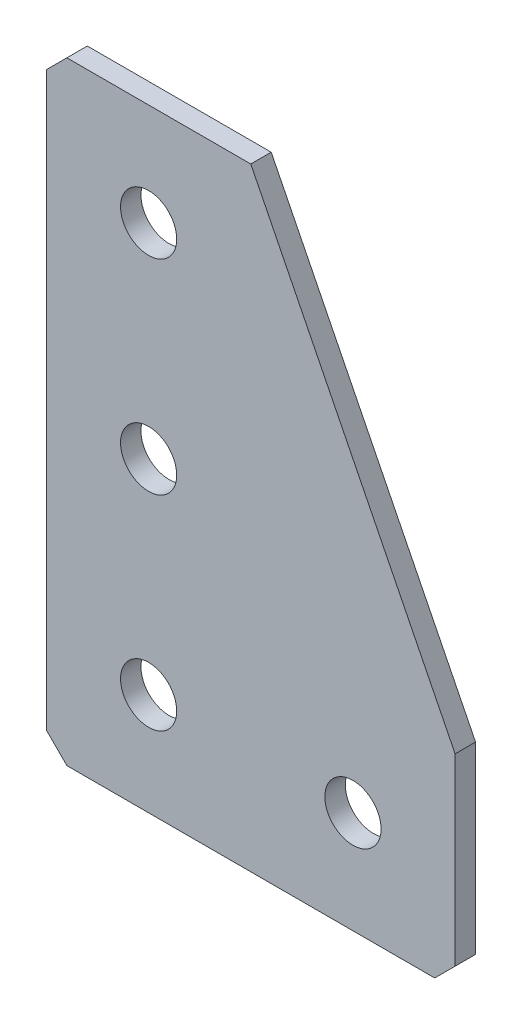
ISO-10303-21;
HEADER;
FILE_DESCRIPTION(('STEP AP214'),'2;1');
FILE_NAME('part.step','',(''),(''),'','','');
FILE_SCHEMA(('AUTOMOTIVE_DESIGN { 1 0 10303 214 1 1 1 1 }'));
ENDSEC;
DATA;
#1=APPLICATION_CONTEXT('core data for automotive mechanical design processes');
#2=APPLICATION_PROTOCOL_DEFINITION('international standard','automotive_design',2000,#1);
#3=PRODUCT_CONTEXT('',#1,'mechanical');
#4=PRODUCT('Part','Part','',(#3));
#5=PRODUCT_RELATED_PRODUCT_CATEGORY('part','',(#4));
#6=PRODUCT_DEFINITION_FORMATION('','',#4);
#7=PRODUCT_DEFINITION_CONTEXT('part definition',#1,'design');
#8=PRODUCT_DEFINITION('design','',#6,#7);
#9=PRODUCT_DEFINITION_SHAPE('','',#8);
#10=(LENGTH_UNIT() NAMED_UNIT(*) SI_UNIT(.MILLI.,.METRE.));
#11=(NAMED_UNIT(*) PLANE_ANGLE_UNIT() SI_UNIT($,.RADIAN.));
#12=(NAMED_UNIT(*) SI_UNIT($,.STERADIAN.) SOLID_ANGLE_UNIT());
#13=UNCERTAINTY_MEASURE_WITH_UNIT(LENGTH_MEASURE(1.E-05),#10,'distance_accuracy_value','');
#14=(GEOMETRIC_REPRESENTATION_CONTEXT(3) GLOBAL_UNCERTAINTY_ASSIGNED_CONTEXT((#13)) GLOBAL_UNIT_ASSIGNED_CONTEXT((#10,
#11,#12)) REPRESENTATION_CONTEXT('',''));
#15=CARTESIAN_POINT('',(0.,0.,0.));
#16=DIRECTION('',(0.,0.,1.));
#17=DIRECTION('',(1.,0.,0.));
#18=AXIS2_PLACEMENT_3D('',#15,#16,#17);
#19=CARTESIAN_POINT('',(20.,0.,-2.));
#20=DIRECTION('',(0.,-1.,0.));
#21=DIRECTION('',(1.,0.,0.));
#22=AXIS2_PLACEMENT_3D('',#19,#20,#21);
#23=PLANE('',#22);
#24=DIRECTION('',(1.,0.,0.));
#25=VECTOR('',#24,1.);
#26=CARTESIAN_POINT('',(20.,0.,-2.));
#27=LINE('',#26,#25);
#28=CARTESIAN_POINT('',(2.00000000000001,0.,-2.));
#29=VERTEX_POINT('',#28);
#30=CARTESIAN_POINT('',(20.,0.,-2.));
#31=VERTEX_POINT('',#30);
#32=EDGE_CURVE('E103',#29,#31,#27,.T.);
#33=ORIENTED_EDGE('',*,*,#32,.F.);
#34=DIRECTION('',(0.,0.,1.));
#35=VECTOR('',#34,1.);
#36=CARTESIAN_POINT('',(2.00000000000001,0.,-2.));
#37=LINE('',#36,#35);
#38=CARTESIAN_POINT('',(2.00000000000001,0.,0.));
#39=VERTEX_POINT('',#38);
#40=EDGE_CURVE('E132',#29,#39,#37,.T.);
#41=ORIENTED_EDGE('',*,*,#40,.T.);
#42=DIRECTION('',(1.,0.,0.));
#43=VECTOR('',#42,1.);
#44=CARTESIAN_POINT('',(20.,0.,0.));
#45=LINE('',#44,#43);
#46=CARTESIAN_POINT('',(20.,0.,0.));
#47=VERTEX_POINT('',#46);
#48=EDGE_CURVE('E129',#39,#47,#45,.T.);
#49=ORIENTED_EDGE('',*,*,#48,.T.);
#50=DIRECTION('',(0.,0.,1.));
#51=VECTOR('',#50,1.);
#52=CARTESIAN_POINT('',(20.,0.,-2.));
#53=LINE('',#52,#51);
#54=EDGE_CURVE('E121',#31,#47,#53,.T.);
#55=ORIENTED_EDGE('',*,*,#54,.F.);
#56=EDGE_LOOP('',(#33,#41,#49,#55));
#57=FACE_BOUND('',#56,.T.);
#58=ADVANCED_FACE('F38',(#57),#23,.F.);
#59=CARTESIAN_POINT('',(40.,-40.,-2.));
#60=DIRECTION('',(-0.894427190999916,-0.447213595499958,0.));
#61=DIRECTION('',(0.447213595499958,-0.894427190999916,0.));
#62=AXIS2_PLACEMENT_3D('',#59,#60,#61);
#63=PLANE('',#62);
#64=DIRECTION('',(0.447213595499958,-0.894427190999916,0.));
#65=VECTOR('',#64,1.);
#66=CARTESIAN_POINT('',(40.,-40.,0.));
#67=LINE('',#66,#65);
#68=CARTESIAN_POINT('',(40.,-40.,0.));
#69=VERTEX_POINT('',#68);
#70=EDGE_CURVE('E187',#47,#69,#67,.T.);
#71=ORIENTED_EDGE('',*,*,#70,.T.);
#72=DIRECTION('',(0.,0.,1.));
#73=VECTOR('',#72,1.);
#74=CARTESIAN_POINT('',(40.,-40.,-2.));
#75=LINE('',#74,#73);
#76=CARTESIAN_POINT('',(40.,-40.,-2.));
#77=VERTEX_POINT('',#76);
#78=EDGE_CURVE('E123',#77,#69,#75,.T.);
#79=ORIENTED_EDGE('',*,*,#78,.F.);
#80=DIRECTION('',(0.447213595499958,-0.894427190999916,0.));
#81=VECTOR('',#80,1.);
#82=CARTESIAN_POINT('',(40.,-40.,-2.));
#83=LINE('',#82,#81);
#84=EDGE_CURVE('E107',#31,#77,#83,.T.);
#85=ORIENTED_EDGE('',*,*,#84,.F.);
#86=ORIENTED_EDGE('',*,*,#54,.T.);
#87=EDGE_LOOP('',(#71,#79,#85,#86));
#88=FACE_BOUND('',#87,.T.);
#89=ADVANCED_FACE('F120',(#88),#63,.F.);
#90=CARTESIAN_POINT('',(40.,-60.,-2.));
#91=DIRECTION('',(-1.,0.,0.));
#92=DIRECTION('',(0.,0.,1.));
#93=AXIS2_PLACEMENT_3D('',#90,#91,#92);
#94=PLANE('',#93);
#95=DIRECTION('',(0.,-1.,0.));
#96=VECTOR('',#95,1.);
#97=CARTESIAN_POINT('',(40.,-60.,0.));
#98=LINE('',#97,#96);
#99=CARTESIAN_POINT('',(40.,-58.,0.));
#100=VERTEX_POINT('',#99);
#101=EDGE_CURVE('E181',#69,#100,#98,.T.);
#102=ORIENTED_EDGE('',*,*,#101,.T.);
#103=DIRECTION('',(0.,0.,-1.));
#104=VECTOR('',#103,1.);
#105=CARTESIAN_POINT('',(40.,-58.,-2.));
#106=LINE('',#105,#104);
#107=CARTESIAN_POINT('',(40.,-58.,-2.));
#108=VERTEX_POINT('',#107);
#109=EDGE_CURVE('E11',#100,#108,#106,.T.);
#110=ORIENTED_EDGE('',*,*,#109,.T.);
#111=DIRECTION('',(0.,-1.,0.));
#112=VECTOR('',#111,1.);
#113=CARTESIAN_POINT('',(40.,-60.,-2.));
#114=LINE('',#113,#112);
#115=EDGE_CURVE('E126',#77,#108,#114,.T.);
#116=ORIENTED_EDGE('',*,*,#115,.F.);
#117=ORIENTED_EDGE('',*,*,#78,.T.);
#118=EDGE_LOOP('',(#102,#110,#116,#117));
#119=FACE_BOUND('',#118,.T.);
#120=ADVANCED_FACE('F266',(#119),#94,.F.);
#121=CARTESIAN_POINT('',(0.,-60.,-2.));
#122=DIRECTION('',(0.,1.,0.));
#123=DIRECTION('',(0.,0.,1.));
#124=AXIS2_PLACEMENT_3D('',#121,#122,#123);
#125=PLANE('',#124);
#126=DIRECTION('',(-1.,0.,0.));
#127=VECTOR('',#126,1.);
#128=CARTESIAN_POINT('',(0.,-60.,-2.));
#129=LINE('',#128,#127);
#130=CARTESIAN_POINT('',(38.,-60.,-2.));
#131=VERTEX_POINT('',#130);
#132=CARTESIAN_POINT('',(2.00000000000001,-60.,-2.));
#133=VERTEX_POINT('',#132);
#134=EDGE_CURVE('E173',#131,#133,#129,.T.);
#135=ORIENTED_EDGE('',*,*,#134,.F.);
#136=DIRECTION('',(0.,0.,1.));
#137=VECTOR('',#136,1.);
#138=CARTESIAN_POINT('',(38.,-60.,-2.));
#139=LINE('',#138,#137);
#140=CARTESIAN_POINT('',(38.,-60.,0.));
#141=VERTEX_POINT('',#140);
#142=EDGE_CURVE('E47',#131,#141,#139,.T.);
#143=ORIENTED_EDGE('',*,*,#142,.T.);
#144=DIRECTION('',(-1.,0.,0.));
#145=VECTOR('',#144,1.);
#146=CARTESIAN_POINT('',(0.,-60.,0.));
#147=LINE('',#146,#145);
#148=CARTESIAN_POINT('',(2.00000000000001,-60.,0.));
#149=VERTEX_POINT('',#148);
#150=EDGE_CURVE('E172',#141,#149,#147,.T.);
#151=ORIENTED_EDGE('',*,*,#150,.T.);
#152=DIRECTION('',(0.,0.,-1.));
#153=VECTOR('',#152,1.);
#154=CARTESIAN_POINT('',(2.00000000000001,-60.,-2.));
#155=LINE('',#154,#153);
#156=EDGE_CURVE('E54',#149,#133,#155,.T.);
#157=ORIENTED_EDGE('',*,*,#156,.T.);
#158=EDGE_LOOP('',(#135,#143,#151,#157));
#159=FACE_BOUND('',#158,.T.);
#160=ADVANCED_FACE('F171',(#159),#125,.F.);
#161=CARTESIAN_POINT('',(0.,0.,-2.));
#162=DIRECTION('',(1.,0.,0.));
#163=DIRECTION('',(0.,0.,-1.));
#164=AXIS2_PLACEMENT_3D('',#161,#162,#163);
#165=PLANE('',#164);
#166=DIRECTION('',(0.,1.,0.));
#167=VECTOR('',#166,1.);
#168=CARTESIAN_POINT('',(0.,0.,0.));
#169=LINE('',#168,#167);
#170=CARTESIAN_POINT('',(0.,-58.,0.));
#171=VERTEX_POINT('',#170);
#172=CARTESIAN_POINT('',(0.,-2.00000000000002,0.));
#173=VERTEX_POINT('',#172);
#174=EDGE_CURVE('E116',#171,#173,#169,.T.);
#175=ORIENTED_EDGE('',*,*,#174,.T.);
#176=DIRECTION('',(0.,0.,-1.));
#177=VECTOR('',#176,1.);
#178=CARTESIAN_POINT('',(0.,-2.00000000000002,-2.));
#179=LINE('',#178,#177);
#180=CARTESIAN_POINT('',(0.,-2.00000000000002,-2.));
#181=VERTEX_POINT('',#180);
#182=EDGE_CURVE('E155',#173,#181,#179,.T.);
#183=ORIENTED_EDGE('',*,*,#182,.T.);
#184=DIRECTION('',(0.,1.,0.));
#185=VECTOR('',#184,1.);
#186=CARTESIAN_POINT('',(0.,0.,-2.));
#187=LINE('',#186,#185);
#188=CARTESIAN_POINT('',(0.,-58.,-2.));
#189=VERTEX_POINT('',#188);
#190=EDGE_CURVE('E139',#189,#181,#187,.T.);
#191=ORIENTED_EDGE('',*,*,#190,.F.);
#192=DIRECTION('',(0.,0.,1.));
#193=VECTOR('',#192,1.);
#194=CARTESIAN_POINT('',(0.,-58.,-2.));
#195=LINE('',#194,#193);
#196=EDGE_CURVE('E151',#189,#171,#195,.T.);
#197=ORIENTED_EDGE('',*,*,#196,.T.);
#198=EDGE_LOOP('',(#175,#183,#191,#197));
#199=FACE_BOUND('',#198,.T.);
#200=ADVANCED_FACE('F238',(#199),#165,.F.);
#201=CARTESIAN_POINT('',(0.,0.,-2.));
#202=DIRECTION('',(0.,0.,1.));
#203=DIRECTION('',(1.,0.,0.));
#204=AXIS2_PLACEMENT_3D('',#201,#202,#203);
#205=PLANE('',#204);
#206=CARTESIAN_POINT('',(30.,-50.,-2.));
#207=DIRECTION('',(0.,0.,-1.));
#208=DIRECTION('',(0.,1.,0.));
#209=AXIS2_PLACEMENT_3D('',#206,#207,#208);
#210=CIRCLE('',#209,2.75);
#211=CARTESIAN_POINT('',(30.,-47.25,-2.));
#212=VERTEX_POINT('',#211);
#213=EDGE_CURVE('E228',#212,#212,#210,.T.);
#214=ORIENTED_EDGE('',*,*,#213,.F.);
#215=EDGE_LOOP('',(#214));
#216=FACE_BOUND('',#215,.T.);
#217=CARTESIAN_POINT('',(10.,-50.,-2.));
#218=DIRECTION('',(0.,0.,-1.));
#219=DIRECTION('',(0.,1.,0.));
#220=AXIS2_PLACEMENT_3D('',#217,#218,#219);
#221=CIRCLE('',#220,2.75);
#222=CARTESIAN_POINT('',(10.,-47.25,-2.));
#223=VERTEX_POINT('',#222);
#224=EDGE_CURVE('E220',#223,#223,#221,.T.);
#225=ORIENTED_EDGE('',*,*,#224,.F.);
#226=EDGE_LOOP('',(#225));
#227=FACE_BOUND('',#226,.T.);
#228=CARTESIAN_POINT('',(10.,-30.,-2.));
#229=DIRECTION('',(0.,0.,-1.));
#230=DIRECTION('',(0.,1.,0.));
#231=AXIS2_PLACEMENT_3D('',#228,#229,#230);
#232=CIRCLE('',#231,2.75);
#233=CARTESIAN_POINT('',(10.,-27.25,-2.));
#234=VERTEX_POINT('',#233);
#235=EDGE_CURVE('E212',#234,#234,#232,.T.);
#236=ORIENTED_EDGE('',*,*,#235,.F.);
#237=EDGE_LOOP('',(#236));
#238=FACE_BOUND('',#237,.T.);
#239=CARTESIAN_POINT('',(10.,-9.99999999999999,-2.));
#240=DIRECTION('',(0.,0.,-1.));
#241=DIRECTION('',(0.,1.,0.));
#242=AXIS2_PLACEMENT_3D('',#239,#240,#241);
#243=CIRCLE('',#242,2.75);
#244=CARTESIAN_POINT('',(10.,-7.24999999999999,-2.));
#245=VERTEX_POINT('',#244);
#246=EDGE_CURVE('E204',#245,#245,#243,.T.);
#247=ORIENTED_EDGE('',*,*,#246,.F.);
#248=EDGE_LOOP('',(#247));
#249=FACE_BOUND('',#248,.T.);
#250=ORIENTED_EDGE('',*,*,#190,.T.);
#251=DIRECTION('',(-0.707106781186546,-0.707106781186549,0.));
#252=VECTOR('',#251,1.);
#253=CARTESIAN_POINT('',(2.00000000000001,0.,-2.));
#254=LINE('',#253,#252);
#255=EDGE_CURVE('E110',#181,#29,#254,.F.);
#256=ORIENTED_EDGE('',*,*,#255,.T.);
#257=ORIENTED_EDGE('',*,*,#32,.T.);
#258=ORIENTED_EDGE('',*,*,#84,.T.);
#259=ORIENTED_EDGE('',*,*,#115,.T.);
#260=DIRECTION('',(0.707106781186545,0.70710678118655,0.));
#261=VECTOR('',#260,1.);
#262=CARTESIAN_POINT('',(38.,-60.,-2.));
#263=LINE('',#262,#261);
#264=EDGE_CURVE('E61',#108,#131,#263,.F.);
#265=ORIENTED_EDGE('',*,*,#264,.T.);
#266=ORIENTED_EDGE('',*,*,#134,.T.);
#267=DIRECTION('',(0.70710678118655,-0.707106781186545,0.));
#268=VECTOR('',#267,1.);
#269=CARTESIAN_POINT('',(0.,-58.,-2.));
#270=LINE('',#269,#268);
#271=EDGE_CURVE('E158',#133,#189,#270,.F.);
#272=ORIENTED_EDGE('',*,*,#271,.T.);
#273=EDGE_LOOP('',(#250,#256,#257,#258,#259,#265,#266,#272));
#274=FACE_BOUND('',#273,.T.);
#275=ADVANCED_FACE('F106',(#216,#227,#238,#249,#274),#205,.F.);
#276=CARTESIAN_POINT('',(0.,0.,0.));
#277=DIRECTION('',(0.,0.,1.));
#278=DIRECTION('',(1.,0.,0.));
#279=AXIS2_PLACEMENT_3D('',#276,#277,#278);
#280=PLANE('',#279);
#281=CARTESIAN_POINT('',(30.,-50.,0.));
#282=DIRECTION('',(0.,0.,-1.));
#283=DIRECTION('',(0.,1.,0.));
#284=AXIS2_PLACEMENT_3D('',#281,#282,#283);
#285=CIRCLE('',#284,2.75);
#286=CARTESIAN_POINT('',(30.,-47.25,0.));
#287=VERTEX_POINT('',#286);
#288=EDGE_CURVE('E224',#287,#287,#285,.T.);
#289=ORIENTED_EDGE('',*,*,#288,.T.);
#290=EDGE_LOOP('',(#289));
#291=FACE_BOUND('',#290,.T.);
#292=CARTESIAN_POINT('',(10.,-50.,0.));
#293=DIRECTION('',(0.,0.,-1.));
#294=DIRECTION('',(0.,1.,0.));
#295=AXIS2_PLACEMENT_3D('',#292,#293,#294);
#296=CIRCLE('',#295,2.75);
#297=CARTESIAN_POINT('',(10.,-47.25,0.));
#298=VERTEX_POINT('',#297);
#299=EDGE_CURVE('E216',#298,#298,#296,.T.);
#300=ORIENTED_EDGE('',*,*,#299,.T.);
#301=EDGE_LOOP('',(#300));
#302=FACE_BOUND('',#301,.T.);
#303=CARTESIAN_POINT('',(10.,-30.,0.));
#304=DIRECTION('',(0.,0.,-1.));
#305=DIRECTION('',(0.,1.,0.));
#306=AXIS2_PLACEMENT_3D('',#303,#304,#305);
#307=CIRCLE('',#306,2.75);
#308=CARTESIAN_POINT('',(10.,-27.25,0.));
#309=VERTEX_POINT('',#308);
#310=EDGE_CURVE('E208',#309,#309,#307,.T.);
#311=ORIENTED_EDGE('',*,*,#310,.T.);
#312=EDGE_LOOP('',(#311));
#313=FACE_BOUND('',#312,.T.);
#314=CARTESIAN_POINT('',(10.,-9.99999999999999,0.));
#315=DIRECTION('',(0.,0.,-1.));
#316=DIRECTION('',(0.,1.,0.));
#317=AXIS2_PLACEMENT_3D('',#314,#315,#316);
#318=CIRCLE('',#317,2.75);
#319=CARTESIAN_POINT('',(10.,-7.25,0.));
#320=VERTEX_POINT('',#319);
#321=EDGE_CURVE('E194',#320,#320,#318,.T.);
#322=ORIENTED_EDGE('',*,*,#321,.T.);
#323=EDGE_LOOP('',(#322));
#324=FACE_BOUND('',#323,.T.);
#325=ORIENTED_EDGE('',*,*,#48,.F.);
#326=DIRECTION('',(0.707106781186546,0.707106781186549,0.));
#327=VECTOR('',#326,1.);
#328=CARTESIAN_POINT('',(1.00000000000001,-1.,0.));
#329=LINE('',#328,#327);
#330=EDGE_CURVE('E148',#39,#173,#329,.F.);
#331=ORIENTED_EDGE('',*,*,#330,.T.);
#332=ORIENTED_EDGE('',*,*,#174,.F.);
#333=DIRECTION('',(-0.70710678118655,0.707106781186545,0.));
#334=VECTOR('',#333,1.);
#335=CARTESIAN_POINT('',(-29.,-29.0000000000002,0.));
#336=LINE('',#335,#334);
#337=EDGE_CURVE('E137',#171,#149,#336,.F.);
#338=ORIENTED_EDGE('',*,*,#337,.T.);
#339=ORIENTED_EDGE('',*,*,#150,.F.);
#340=DIRECTION('',(-0.707106781186545,-0.70710678118655,0.));
#341=VECTOR('',#340,1.);
#342=CARTESIAN_POINT('',(49.0000000000001,-48.9999999999998,0.));
#343=LINE('',#342,#341);
#344=EDGE_CURVE('E145',#141,#100,#343,.F.);
#345=ORIENTED_EDGE('',*,*,#344,.T.);
#346=ORIENTED_EDGE('',*,*,#101,.F.);
#347=ORIENTED_EDGE('',*,*,#70,.F.);
#348=EDGE_LOOP('',(#325,#331,#332,#338,#339,#345,#346,#347));
#349=FACE_BOUND('',#348,.T.);
#350=ADVANCED_FACE('F176',(#291,#302,#313,#324,#349),#280,.T.);
#351=CARTESIAN_POINT('',(10.,-9.99999999999999,-2.));
#352=DIRECTION('',(0.,0.,-1.));
#353=DIRECTION('',(0.,1.,0.));
#354=AXIS2_PLACEMENT_3D('',#351,#352,#353);
#355=CYLINDRICAL_SURFACE('',#354,2.75);
#356=ORIENTED_EDGE('',*,*,#321,.F.);
#357=EDGE_LOOP('',(#356));
#358=FACE_BOUND('',#357,.T.);
#359=ORIENTED_EDGE('',*,*,#246,.T.);
#360=EDGE_LOOP('',(#359));
#361=FACE_BOUND('',#360,.T.);
#362=ADVANCED_FACE('F246',(#358,#361),#355,.F.);
#363=CARTESIAN_POINT('',(10.,-30.,-2.));
#364=DIRECTION('',(0.,0.,-1.));
#365=DIRECTION('',(0.,1.,0.));
#366=AXIS2_PLACEMENT_3D('',#363,#364,#365);
#367=CYLINDRICAL_SURFACE('',#366,2.75);
#368=ORIENTED_EDGE('',*,*,#310,.F.);
#369=EDGE_LOOP('',(#368));
#370=FACE_BOUND('',#369,.T.);
#371=ORIENTED_EDGE('',*,*,#235,.T.);
#372=EDGE_LOOP('',(#371));
#373=FACE_BOUND('',#372,.T.);
#374=ADVANCED_FACE('F248',(#370,#373),#367,.F.);
#375=CARTESIAN_POINT('',(10.,-50.,-2.));
#376=DIRECTION('',(0.,0.,-1.));
#377=DIRECTION('',(0.,1.,0.));
#378=AXIS2_PLACEMENT_3D('',#375,#376,#377);
#379=CYLINDRICAL_SURFACE('',#378,2.75);
#380=ORIENTED_EDGE('',*,*,#299,.F.);
#381=EDGE_LOOP('',(#380));
#382=FACE_BOUND('',#381,.T.);
#383=ORIENTED_EDGE('',*,*,#224,.T.);
#384=EDGE_LOOP('',(#383));
#385=FACE_BOUND('',#384,.T.);
#386=ADVANCED_FACE('F255',(#382,#385),#379,.F.);
#387=CARTESIAN_POINT('',(30.,-50.,-2.));
#388=DIRECTION('',(0.,0.,-1.));
#389=DIRECTION('',(0.,1.,0.));
#390=AXIS2_PLACEMENT_3D('',#387,#388,#389);
#391=CYLINDRICAL_SURFACE('',#390,2.75);
#392=ORIENTED_EDGE('',*,*,#288,.F.);
#393=EDGE_LOOP('',(#392));
#394=FACE_BOUND('',#393,.T.);
#395=ORIENTED_EDGE('',*,*,#213,.T.);
#396=EDGE_LOOP('',(#395));
#397=FACE_BOUND('',#396,.T.);
#398=ADVANCED_FACE('F234',(#394,#397),#391,.F.);
#399=CARTESIAN_POINT('',(2.00000000000001,0.,-2.));
#400=DIRECTION('',(0.707106781186549,-0.707106781186546,0.));
#401=DIRECTION('',(0.,0.,1.));
#402=AXIS2_PLACEMENT_3D('',#399,#400,#401);
#403=PLANE('',#402);
#404=ORIENTED_EDGE('',*,*,#255,.F.);
#405=ORIENTED_EDGE('',*,*,#182,.F.);
#406=ORIENTED_EDGE('',*,*,#330,.F.);
#407=ORIENTED_EDGE('',*,*,#40,.F.);
#408=EDGE_LOOP('',(#404,#405,#406,#407));
#409=FACE_BOUND('',#408,.T.);
#410=ADVANCED_FACE('F270',(#409),#403,.F.);
#411=CARTESIAN_POINT('',(38.,-60.,-2.));
#412=DIRECTION('',(-0.70710678118655,0.707106781186545,0.));
#413=DIRECTION('',(0.,0.,1.));
#414=AXIS2_PLACEMENT_3D('',#411,#412,#413);
#415=PLANE('',#414);
#416=ORIENTED_EDGE('',*,*,#264,.F.);
#417=ORIENTED_EDGE('',*,*,#109,.F.);
#418=ORIENTED_EDGE('',*,*,#344,.F.);
#419=ORIENTED_EDGE('',*,*,#142,.F.);
#420=EDGE_LOOP('',(#416,#417,#418,#419));
#421=FACE_BOUND('',#420,.T.);
#422=ADVANCED_FACE('F272',(#421),#415,.F.);
#423=CARTESIAN_POINT('',(0.,-58.,-2.));
#424=DIRECTION('',(0.707106781186545,0.70710678118655,0.));
#425=DIRECTION('',(0.,0.,1.));
#426=AXIS2_PLACEMENT_3D('',#423,#424,#425);
#427=PLANE('',#426);
#428=ORIENTED_EDGE('',*,*,#271,.F.);
#429=ORIENTED_EDGE('',*,*,#156,.F.);
#430=ORIENTED_EDGE('',*,*,#337,.F.);
#431=ORIENTED_EDGE('',*,*,#196,.F.);
#432=EDGE_LOOP('',(#428,#429,#430,#431));
#433=FACE_BOUND('',#432,.T.);
#434=ADVANCED_FACE('F40',(#433),#427,.F.);
#435=CLOSED_SHELL('',(#58,#89,#120,#160,#200,#275,#350,#362,#374,#386,#398,#410,#422,#434));
#436=MANIFOLD_SOLID_BREP('B2',#435);
#437=ADVANCED_BREP_SHAPE_REPRESENTATION('',(#18,#436),#14);
#438=SHAPE_DEFINITION_REPRESENTATION(#9,#437);
ENDSEC;
END-ISO-10303-21;
